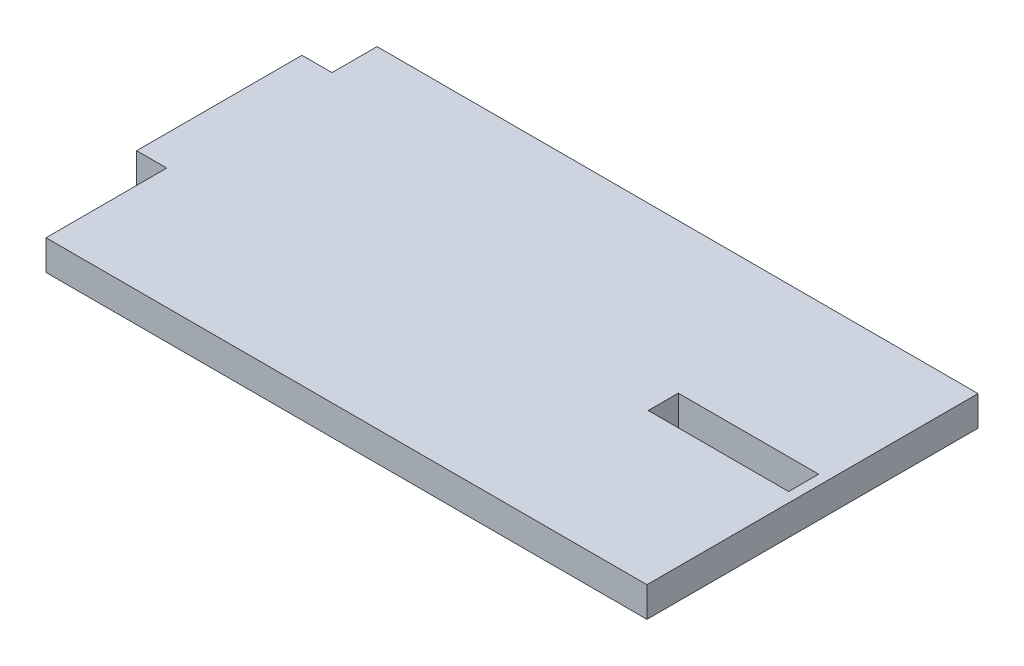
ISO-10303-21;
HEADER;
FILE_DESCRIPTION(('STEP AP214'),'2;1');
FILE_NAME('part.step','',(''),(''),'','','');
FILE_SCHEMA(('AUTOMOTIVE_DESIGN { 1 0 10303 214 1 1 1 1 }'));
ENDSEC;
DATA;
#1=APPLICATION_CONTEXT('core data for automotive mechanical design processes');
#2=APPLICATION_PROTOCOL_DEFINITION('international standard','automotive_design',2000,#1);
#3=PRODUCT_CONTEXT('',#1,'mechanical');
#4=PRODUCT('Part','Part','',(#3));
#5=PRODUCT_RELATED_PRODUCT_CATEGORY('part','',(#4));
#6=PRODUCT_DEFINITION_FORMATION('','',#4);
#7=PRODUCT_DEFINITION_CONTEXT('part definition',#1,'design');
#8=PRODUCT_DEFINITION('design','',#6,#7);
#9=PRODUCT_DEFINITION_SHAPE('','',#8);
#10=(LENGTH_UNIT() NAMED_UNIT(*) SI_UNIT(.MILLI.,.METRE.));
#11=(NAMED_UNIT(*) PLANE_ANGLE_UNIT() SI_UNIT($,.RADIAN.));
#12=(NAMED_UNIT(*) SI_UNIT($,.STERADIAN.) SOLID_ANGLE_UNIT());
#13=UNCERTAINTY_MEASURE_WITH_UNIT(LENGTH_MEASURE(1.E-05),#10,'distance_accuracy_value','');
#14=(GEOMETRIC_REPRESENTATION_CONTEXT(3) GLOBAL_UNCERTAINTY_ASSIGNED_CONTEXT((#13)) GLOBAL_UNIT_ASSIGNED_CONTEXT((#10,
#11,#12)) REPRESENTATION_CONTEXT('',''));
#15=CARTESIAN_POINT('',(0.,0.,0.));
#16=DIRECTION('',(0.,0.,1.));
#17=DIRECTION('',(1.,0.,0.));
#18=AXIS2_PLACEMENT_3D('',#15,#16,#17);
#19=CARTESIAN_POINT('',(0.,4.,0.));
#20=DIRECTION('',(0.,-1.,0.));
#21=DIRECTION('',(0.,0.,-1.));
#22=AXIS2_PLACEMENT_3D('',#19,#20,#21);
#23=PLANE('',#22);
#24=DIRECTION('',(0.,0.,1.));
#25=VECTOR('',#24,1.);
#26=CARTESIAN_POINT('',(0.,4.,0.));
#27=LINE('',#26,#25);
#28=CARTESIAN_POINT('',(0.,4.,0.));
#29=VERTEX_POINT('',#28);
#30=CARTESIAN_POINT('',(0.,4.,6.));
#31=VERTEX_POINT('',#30);
#32=EDGE_CURVE('E187',#29,#31,#27,.T.);
#33=ORIENTED_EDGE('',*,*,#32,.T.);
#34=DIRECTION('',(-1.,0.,0.));
#35=VECTOR('',#34,1.);
#36=CARTESIAN_POINT('',(0.,4.,6.));
#37=LINE('',#36,#35);
#38=CARTESIAN_POINT('',(-4.,4.,6.));
#39=VERTEX_POINT('',#38);
#40=EDGE_CURVE('E191',#31,#39,#37,.T.);
#41=ORIENTED_EDGE('',*,*,#40,.T.);
#42=DIRECTION('',(0.,0.,1.));
#43=VECTOR('',#42,1.);
#44=CARTESIAN_POINT('',(-4.,4.,6.));
#45=LINE('',#44,#43);
#46=CARTESIAN_POINT('',(-4.,4.,28.));
#47=VERTEX_POINT('',#46);
#48=EDGE_CURVE('E195',#39,#47,#45,.T.);
#49=ORIENTED_EDGE('',*,*,#48,.T.);
#50=DIRECTION('',(1.,0.,0.));
#51=VECTOR('',#50,1.);
#52=CARTESIAN_POINT('',(-4.,4.,28.));
#53=LINE('',#52,#51);
#54=CARTESIAN_POINT('',(0.,4.,28.));
#55=VERTEX_POINT('',#54);
#56=EDGE_CURVE('E198',#47,#55,#53,.T.);
#57=ORIENTED_EDGE('',*,*,#56,.T.);
#58=DIRECTION('',(0.,0.,1.));
#59=VECTOR('',#58,1.);
#60=CARTESIAN_POINT('',(0.,4.,28.));
#61=LINE('',#60,#59);
#62=CARTESIAN_POINT('',(0.,4.,44.07));
#63=VERTEX_POINT('',#62);
#64=EDGE_CURVE('E201',#55,#63,#61,.T.);
#65=ORIENTED_EDGE('',*,*,#64,.T.);
#66=DIRECTION('',(1.,0.,0.));
#67=VECTOR('',#66,1.);
#68=CARTESIAN_POINT('',(0.,4.,44.07));
#69=LINE('',#68,#67);
#70=CARTESIAN_POINT('',(80.,4.,44.07));
#71=VERTEX_POINT('',#70);
#72=EDGE_CURVE('E204',#63,#71,#69,.T.);
#73=ORIENTED_EDGE('',*,*,#72,.T.);
#74=DIRECTION('',(0.,0.,-1.));
#75=VECTOR('',#74,1.);
#76=CARTESIAN_POINT('',(80.,4.,0.));
#77=LINE('',#76,#75);
#78=CARTESIAN_POINT('',(80.,4.,0.));
#79=VERTEX_POINT('',#78);
#80=EDGE_CURVE('E207',#71,#79,#77,.T.);
#81=ORIENTED_EDGE('',*,*,#80,.T.);
#82=DIRECTION('',(-1.,0.,0.));
#83=VECTOR('',#82,1.);
#84=CARTESIAN_POINT('',(0.,4.,0.));
#85=LINE('',#84,#83);
#86=EDGE_CURVE('E210',#79,#29,#85,.T.);
#87=ORIENTED_EDGE('',*,*,#86,.T.);
#88=EDGE_LOOP('',(#33,#41,#49,#57,#65,#73,#81,#87));
#89=FACE_BOUND('',#88,.T.);
#90=DIRECTION('',(0.,0.,1.));
#91=VECTOR('',#90,1.);
#92=CARTESIAN_POINT('',(60.,4.,19.9));
#93=LINE('',#92,#91);
#94=CARTESIAN_POINT('',(60.,4.,19.9));
#95=VERTEX_POINT('',#94);
#96=CARTESIAN_POINT('',(60.,4.,23.9));
#97=VERTEX_POINT('',#96);
#98=EDGE_CURVE('E139',#95,#97,#93,.T.);
#99=ORIENTED_EDGE('',*,*,#98,.F.);
#100=DIRECTION('',(-1.,0.,0.));
#101=VECTOR('',#100,1.);
#102=CARTESIAN_POINT('',(60.,4.,19.9));
#103=LINE('',#102,#101);
#104=CARTESIAN_POINT('',(78.6889918210061,4.,19.9));
#105=VERTEX_POINT('',#104);
#106=EDGE_CURVE('E165',#105,#95,#103,.T.);
#107=ORIENTED_EDGE('',*,*,#106,.F.);
#108=DIRECTION('',(0.,0.,-1.));
#109=VECTOR('',#108,1.);
#110=CARTESIAN_POINT('',(78.6889918210061,4.,19.9));
#111=LINE('',#110,#109);
#112=CARTESIAN_POINT('',(78.6889918210061,4.,23.9));
#113=VERTEX_POINT('',#112);
#114=EDGE_CURVE('E161',#113,#105,#111,.T.);
#115=ORIENTED_EDGE('',*,*,#114,.F.);
#116=DIRECTION('',(1.,0.,0.));
#117=VECTOR('',#116,1.);
#118=CARTESIAN_POINT('',(60.,4.,23.9));
#119=LINE('',#118,#117);
#120=EDGE_CURVE('E148',#97,#113,#119,.T.);
#121=ORIENTED_EDGE('',*,*,#120,.F.);
#122=EDGE_LOOP('',(#99,#107,#115,#121));
#123=FACE_BOUND('',#122,.T.);
#124=ADVANCED_FACE('F49',(#89,#123),#23,.F.);
#125=CARTESIAN_POINT('',(0.,0.,0.));
#126=DIRECTION('',(0.,-1.,0.));
#127=DIRECTION('',(0.,0.,-1.));
#128=AXIS2_PLACEMENT_3D('',#125,#126,#127);
#129=PLANE('',#128);
#130=DIRECTION('',(0.,0.,1.));
#131=VECTOR('',#130,1.);
#132=CARTESIAN_POINT('',(0.,0.,0.));
#133=LINE('',#132,#131);
#134=CARTESIAN_POINT('',(0.,0.,0.));
#135=VERTEX_POINT('',#134);
#136=CARTESIAN_POINT('',(0.,0.,6.));
#137=VERTEX_POINT('',#136);
#138=EDGE_CURVE('E157',#135,#137,#133,.T.);
#139=ORIENTED_EDGE('',*,*,#138,.F.);
#140=DIRECTION('',(-1.,0.,0.));
#141=VECTOR('',#140,1.);
#142=CARTESIAN_POINT('',(0.,0.,0.));
#143=LINE('',#142,#141);
#144=CARTESIAN_POINT('',(80.,0.,0.));
#145=VERTEX_POINT('',#144);
#146=EDGE_CURVE('E192',#145,#135,#143,.T.);
#147=ORIENTED_EDGE('',*,*,#146,.F.);
#148=DIRECTION('',(0.,0.,-1.));
#149=VECTOR('',#148,1.);
#150=CARTESIAN_POINT('',(80.,0.,0.));
#151=LINE('',#150,#149);
#152=CARTESIAN_POINT('',(80.,0.,44.07));
#153=VERTEX_POINT('',#152);
#154=EDGE_CURVE('E232',#153,#145,#151,.T.);
#155=ORIENTED_EDGE('',*,*,#154,.F.);
#156=DIRECTION('',(1.,0.,0.));
#157=VECTOR('',#156,1.);
#158=CARTESIAN_POINT('',(0.,0.,44.07));
#159=LINE('',#158,#157);
#160=CARTESIAN_POINT('',(0.,0.,44.07));
#161=VERTEX_POINT('',#160);
#162=EDGE_CURVE('E229',#161,#153,#159,.T.);
#163=ORIENTED_EDGE('',*,*,#162,.F.);
#164=DIRECTION('',(0.,0.,1.));
#165=VECTOR('',#164,1.);
#166=CARTESIAN_POINT('',(0.,0.,28.));
#167=LINE('',#166,#165);
#168=CARTESIAN_POINT('',(0.,0.,28.));
#169=VERTEX_POINT('',#168);
#170=EDGE_CURVE('E226',#169,#161,#167,.T.);
#171=ORIENTED_EDGE('',*,*,#170,.F.);
#172=DIRECTION('',(1.,0.,0.));
#173=VECTOR('',#172,1.);
#174=CARTESIAN_POINT('',(-4.,0.,28.));
#175=LINE('',#174,#173);
#176=CARTESIAN_POINT('',(-4.,0.,28.));
#177=VERTEX_POINT('',#176);
#178=EDGE_CURVE('E223',#177,#169,#175,.T.);
#179=ORIENTED_EDGE('',*,*,#178,.F.);
#180=DIRECTION('',(0.,0.,1.));
#181=VECTOR('',#180,1.);
#182=CARTESIAN_POINT('',(-4.,0.,6.));
#183=LINE('',#182,#181);
#184=CARTESIAN_POINT('',(-4.,0.,6.));
#185=VERTEX_POINT('',#184);
#186=EDGE_CURVE('E220',#185,#177,#183,.T.);
#187=ORIENTED_EDGE('',*,*,#186,.F.);
#188=DIRECTION('',(-1.,0.,0.));
#189=VECTOR('',#188,1.);
#190=CARTESIAN_POINT('',(0.,0.,6.));
#191=LINE('',#190,#189);
#192=EDGE_CURVE('E217',#137,#185,#191,.T.);
#193=ORIENTED_EDGE('',*,*,#192,.F.);
#194=EDGE_LOOP('',(#139,#147,#155,#163,#171,#179,#187,#193));
#195=FACE_BOUND('',#194,.T.);
#196=DIRECTION('',(-1.,0.,0.));
#197=VECTOR('',#196,1.);
#198=CARTESIAN_POINT('',(60.,0.,19.9));
#199=LINE('',#198,#197);
#200=CARTESIAN_POINT('',(78.6889918210061,0.,19.9));
#201=VERTEX_POINT('',#200);
#202=CARTESIAN_POINT('',(60.,0.,19.9));
#203=VERTEX_POINT('',#202);
#204=EDGE_CURVE('E149',#201,#203,#199,.T.);
#205=ORIENTED_EDGE('',*,*,#204,.T.);
#206=DIRECTION('',(0.,0.,1.));
#207=VECTOR('',#206,1.);
#208=CARTESIAN_POINT('',(60.,0.,19.9));
#209=LINE('',#208,#207);
#210=CARTESIAN_POINT('',(60.,0.,23.9));
#211=VERTEX_POINT('',#210);
#212=EDGE_CURVE('E73',#203,#211,#209,.T.);
#213=ORIENTED_EDGE('',*,*,#212,.T.);
#214=DIRECTION('',(1.,0.,0.));
#215=VECTOR('',#214,1.);
#216=CARTESIAN_POINT('',(60.,0.,23.9));
#217=LINE('',#216,#215);
#218=CARTESIAN_POINT('',(78.6889918210061,0.,23.9));
#219=VERTEX_POINT('',#218);
#220=EDGE_CURVE('E155',#211,#219,#217,.T.);
#221=ORIENTED_EDGE('',*,*,#220,.T.);
#222=DIRECTION('',(0.,0.,-1.));
#223=VECTOR('',#222,1.);
#224=CARTESIAN_POINT('',(78.6889918210061,0.,19.9));
#225=LINE('',#224,#223);
#226=EDGE_CURVE('E174',#219,#201,#225,.T.);
#227=ORIENTED_EDGE('',*,*,#226,.T.);
#228=EDGE_LOOP('',(#205,#213,#221,#227));
#229=FACE_BOUND('',#228,.T.);
#230=ADVANCED_FACE('F271',(#195,#229),#129,.T.);
#231=CARTESIAN_POINT('',(0.,4.,0.));
#232=DIRECTION('',(1.,0.,0.));
#233=DIRECTION('',(0.,0.,-1.));
#234=AXIS2_PLACEMENT_3D('',#231,#232,#233);
#235=PLANE('',#234);
#236=ORIENTED_EDGE('',*,*,#138,.T.);
#237=DIRECTION('',(0.,-1.,0.));
#238=VECTOR('',#237,1.);
#239=CARTESIAN_POINT('',(0.,4.,6.));
#240=LINE('',#239,#238);
#241=EDGE_CURVE('E11',#31,#137,#240,.T.);
#242=ORIENTED_EDGE('',*,*,#241,.F.);
#243=ORIENTED_EDGE('',*,*,#32,.F.);
#244=DIRECTION('',(0.,-1.,0.));
#245=VECTOR('',#244,1.);
#246=CARTESIAN_POINT('',(0.,4.,0.));
#247=LINE('',#246,#245);
#248=EDGE_CURVE('E213',#29,#135,#247,.T.);
#249=ORIENTED_EDGE('',*,*,#248,.T.);
#250=EDGE_LOOP('',(#236,#242,#243,#249));
#251=FACE_BOUND('',#250,.T.);
#252=ADVANCED_FACE('F51',(#251),#235,.F.);
#253=CARTESIAN_POINT('',(0.,4.,6.));
#254=DIRECTION('',(0.,0.,1.));
#255=DIRECTION('',(1.,0.,0.));
#256=AXIS2_PLACEMENT_3D('',#253,#254,#255);
#257=PLANE('',#256);
#258=ORIENTED_EDGE('',*,*,#192,.T.);
#259=DIRECTION('',(0.,-1.,0.));
#260=VECTOR('',#259,1.);
#261=CARTESIAN_POINT('',(-4.,4.,6.));
#262=LINE('',#261,#260);
#263=EDGE_CURVE('E58',#39,#185,#262,.T.);
#264=ORIENTED_EDGE('',*,*,#263,.F.);
#265=ORIENTED_EDGE('',*,*,#40,.F.);
#266=ORIENTED_EDGE('',*,*,#241,.T.);
#267=EDGE_LOOP('',(#258,#264,#265,#266));
#268=FACE_BOUND('',#267,.T.);
#269=ADVANCED_FACE('F288',(#268),#257,.F.);
#270=CARTESIAN_POINT('',(-4.,4.,6.));
#271=DIRECTION('',(1.,0.,0.));
#272=DIRECTION('',(0.,0.,-1.));
#273=AXIS2_PLACEMENT_3D('',#270,#271,#272);
#274=PLANE('',#273);
#275=ORIENTED_EDGE('',*,*,#186,.T.);
#276=DIRECTION('',(0.,-1.,0.));
#277=VECTOR('',#276,1.);
#278=CARTESIAN_POINT('',(-4.,4.,28.));
#279=LINE('',#278,#277);
#280=EDGE_CURVE('E256',#47,#177,#279,.T.);
#281=ORIENTED_EDGE('',*,*,#280,.F.);
#282=ORIENTED_EDGE('',*,*,#48,.F.);
#283=ORIENTED_EDGE('',*,*,#263,.T.);
#284=EDGE_LOOP('',(#275,#281,#282,#283));
#285=FACE_BOUND('',#284,.T.);
#286=ADVANCED_FACE('F265',(#285),#274,.F.);
#287=CARTESIAN_POINT('',(-4.,4.,28.));
#288=DIRECTION('',(0.,0.,-1.));
#289=DIRECTION('',(-1.,0.,0.));
#290=AXIS2_PLACEMENT_3D('',#287,#288,#289);
#291=PLANE('',#290);
#292=ORIENTED_EDGE('',*,*,#178,.T.);
#293=DIRECTION('',(0.,-1.,0.));
#294=VECTOR('',#293,1.);
#295=CARTESIAN_POINT('',(0.,4.,28.));
#296=LINE('',#295,#294);
#297=EDGE_CURVE('E252',#55,#169,#296,.T.);
#298=ORIENTED_EDGE('',*,*,#297,.F.);
#299=ORIENTED_EDGE('',*,*,#56,.F.);
#300=ORIENTED_EDGE('',*,*,#280,.T.);
#301=EDGE_LOOP('',(#292,#298,#299,#300));
#302=FACE_BOUND('',#301,.T.);
#303=ADVANCED_FACE('F277',(#302),#291,.F.);
#304=CARTESIAN_POINT('',(0.,4.,28.));
#305=DIRECTION('',(1.,0.,0.));
#306=DIRECTION('',(0.,0.,-1.));
#307=AXIS2_PLACEMENT_3D('',#304,#305,#306);
#308=PLANE('',#307);
#309=ORIENTED_EDGE('',*,*,#170,.T.);
#310=DIRECTION('',(0.,-1.,0.));
#311=VECTOR('',#310,1.);
#312=CARTESIAN_POINT('',(0.,4.,44.07));
#313=LINE('',#312,#311);
#314=EDGE_CURVE('E248',#63,#161,#313,.T.);
#315=ORIENTED_EDGE('',*,*,#314,.F.);
#316=ORIENTED_EDGE('',*,*,#64,.F.);
#317=ORIENTED_EDGE('',*,*,#297,.T.);
#318=EDGE_LOOP('',(#309,#315,#316,#317));
#319=FACE_BOUND('',#318,.T.);
#320=ADVANCED_FACE('F281',(#319),#308,.F.);
#321=CARTESIAN_POINT('',(0.,4.,44.07));
#322=DIRECTION('',(0.,0.,-1.));
#323=DIRECTION('',(-1.,0.,0.));
#324=AXIS2_PLACEMENT_3D('',#321,#322,#323);
#325=PLANE('',#324);
#326=ORIENTED_EDGE('',*,*,#162,.T.);
#327=DIRECTION('',(0.,-1.,0.));
#328=VECTOR('',#327,1.);
#329=CARTESIAN_POINT('',(80.,4.,44.07));
#330=LINE('',#329,#328);
#331=EDGE_CURVE('E244',#71,#153,#330,.T.);
#332=ORIENTED_EDGE('',*,*,#331,.F.);
#333=ORIENTED_EDGE('',*,*,#72,.F.);
#334=ORIENTED_EDGE('',*,*,#314,.T.);
#335=EDGE_LOOP('',(#326,#332,#333,#334));
#336=FACE_BOUND('',#335,.T.);
#337=ADVANCED_FACE('F301',(#336),#325,.F.);
#338=CARTESIAN_POINT('',(80.,4.,0.));
#339=DIRECTION('',(-1.,0.,0.));
#340=DIRECTION('',(0.,0.,1.));
#341=AXIS2_PLACEMENT_3D('',#338,#339,#340);
#342=PLANE('',#341);
#343=ORIENTED_EDGE('',*,*,#154,.T.);
#344=DIRECTION('',(0.,-1.,0.));
#345=VECTOR('',#344,1.);
#346=CARTESIAN_POINT('',(80.,4.,0.));
#347=LINE('',#346,#345);
#348=EDGE_CURVE('E240',#79,#145,#347,.T.);
#349=ORIENTED_EDGE('',*,*,#348,.F.);
#350=ORIENTED_EDGE('',*,*,#80,.F.);
#351=ORIENTED_EDGE('',*,*,#331,.T.);
#352=EDGE_LOOP('',(#343,#349,#350,#351));
#353=FACE_BOUND('',#352,.T.);
#354=ADVANCED_FACE('F299',(#353),#342,.F.);
#355=CARTESIAN_POINT('',(0.,4.,0.));
#356=DIRECTION('',(0.,0.,1.));
#357=DIRECTION('',(1.,0.,0.));
#358=AXIS2_PLACEMENT_3D('',#355,#356,#357);
#359=PLANE('',#358);
#360=ORIENTED_EDGE('',*,*,#146,.T.);
#361=ORIENTED_EDGE('',*,*,#248,.F.);
#362=ORIENTED_EDGE('',*,*,#86,.F.);
#363=ORIENTED_EDGE('',*,*,#348,.T.);
#364=EDGE_LOOP('',(#360,#361,#362,#363));
#365=FACE_BOUND('',#364,.T.);
#366=ADVANCED_FACE('F294',(#365),#359,.F.);
#367=CARTESIAN_POINT('',(60.,4.,19.9));
#368=DIRECTION('',(1.,0.,0.));
#369=DIRECTION('',(0.,0.,-1.));
#370=AXIS2_PLACEMENT_3D('',#367,#368,#369);
#371=PLANE('',#370);
#372=ORIENTED_EDGE('',*,*,#212,.F.);
#373=DIRECTION('',(0.,-1.,0.));
#374=VECTOR('',#373,1.);
#375=CARTESIAN_POINT('',(60.,4.,19.9));
#376=LINE('',#375,#374);
#377=EDGE_CURVE('E143',#95,#203,#376,.T.);
#378=ORIENTED_EDGE('',*,*,#377,.F.);
#379=ORIENTED_EDGE('',*,*,#98,.T.);
#380=DIRECTION('',(0.,-1.,0.));
#381=VECTOR('',#380,1.);
#382=CARTESIAN_POINT('',(60.,4.,23.9));
#383=LINE('',#382,#381);
#384=EDGE_CURVE('E142',#97,#211,#383,.T.);
#385=ORIENTED_EDGE('',*,*,#384,.T.);
#386=EDGE_LOOP('',(#372,#378,#379,#385));
#387=FACE_BOUND('',#386,.T.);
#388=ADVANCED_FACE('F141',(#387),#371,.T.);
#389=CARTESIAN_POINT('',(60.,4.,23.9));
#390=DIRECTION('',(0.,0.,-1.));
#391=DIRECTION('',(-1.,0.,0.));
#392=AXIS2_PLACEMENT_3D('',#389,#390,#391);
#393=PLANE('',#392);
#394=ORIENTED_EDGE('',*,*,#220,.F.);
#395=ORIENTED_EDGE('',*,*,#384,.F.);
#396=ORIENTED_EDGE('',*,*,#120,.T.);
#397=DIRECTION('',(0.,-1.,0.));
#398=VECTOR('',#397,1.);
#399=CARTESIAN_POINT('',(78.6889918210061,4.,23.9));
#400=LINE('',#399,#398);
#401=EDGE_CURVE('E158',#113,#219,#400,.T.);
#402=ORIENTED_EDGE('',*,*,#401,.T.);
#403=EDGE_LOOP('',(#394,#395,#396,#402));
#404=FACE_BOUND('',#403,.T.);
#405=ADVANCED_FACE('F152',(#404),#393,.T.);
#406=CARTESIAN_POINT('',(78.6889918210061,4.,19.9));
#407=DIRECTION('',(-1.,0.,0.));
#408=DIRECTION('',(0.,0.,1.));
#409=AXIS2_PLACEMENT_3D('',#406,#407,#408);
#410=PLANE('',#409);
#411=ORIENTED_EDGE('',*,*,#226,.F.);
#412=ORIENTED_EDGE('',*,*,#401,.F.);
#413=ORIENTED_EDGE('',*,*,#114,.T.);
#414=DIRECTION('',(0.,-1.,0.));
#415=VECTOR('',#414,1.);
#416=CARTESIAN_POINT('',(78.6889918210061,4.,19.9));
#417=LINE('',#416,#415);
#418=EDGE_CURVE('E65',#105,#201,#417,.T.);
#419=ORIENTED_EDGE('',*,*,#418,.T.);
#420=EDGE_LOOP('',(#411,#412,#413,#419));
#421=FACE_BOUND('',#420,.T.);
#422=ADVANCED_FACE('F326',(#421),#410,.T.);
#423=CARTESIAN_POINT('',(60.,4.,19.9));
#424=DIRECTION('',(0.,0.,1.));
#425=DIRECTION('',(1.,0.,0.));
#426=AXIS2_PLACEMENT_3D('',#423,#424,#425);
#427=PLANE('',#426);
#428=ORIENTED_EDGE('',*,*,#204,.F.);
#429=ORIENTED_EDGE('',*,*,#418,.F.);
#430=ORIENTED_EDGE('',*,*,#106,.T.);
#431=ORIENTED_EDGE('',*,*,#377,.T.);
#432=EDGE_LOOP('',(#428,#429,#430,#431));
#433=FACE_BOUND('',#432,.T.);
#434=ADVANCED_FACE('F330',(#433),#427,.T.);
#435=CLOSED_SHELL('',(#124,#230,#252,#269,#286,#303,#320,#337,#354,#366,#388,#405,#422,#434));
#436=MANIFOLD_SOLID_BREP('B2',#435);
#437=ADVANCED_BREP_SHAPE_REPRESENTATION('',(#18,#436),#14);
#438=SHAPE_DEFINITION_REPRESENTATION(#9,#437);
ENDSEC;
END-ISO-10303-21;
